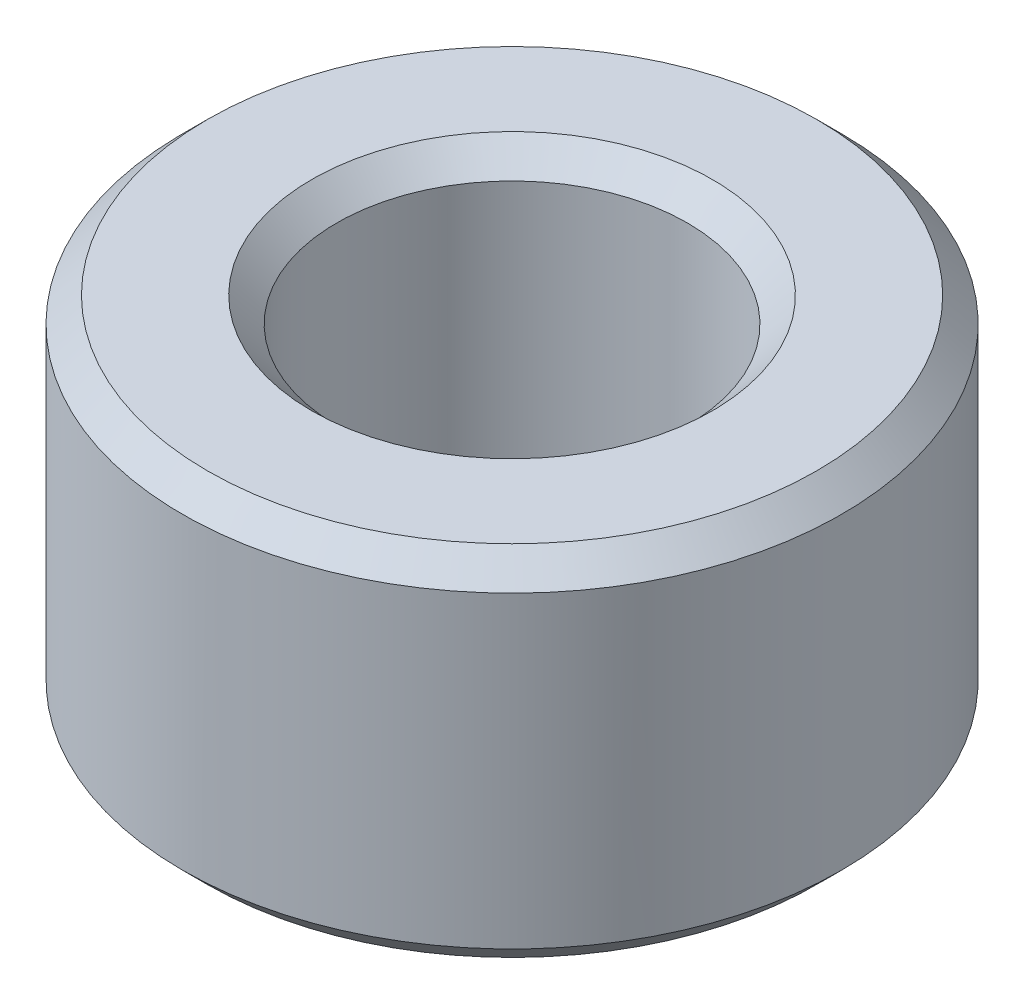
ISO-10303-21;
HEADER;
FILE_DESCRIPTION(('STEP AP214'),'2;1');
FILE_NAME('part.step','',(''),(''),'','','');
FILE_SCHEMA(('AUTOMOTIVE_DESIGN { 1 0 10303 214 1 1 1 1 }'));
ENDSEC;
DATA;
#1=APPLICATION_CONTEXT('core data for automotive mechanical design processes');
#2=APPLICATION_PROTOCOL_DEFINITION('international standard','automotive_design',2000,#1);
#3=PRODUCT_CONTEXT('',#1,'mechanical');
#4=PRODUCT('Part','Part','',(#3));
#5=PRODUCT_RELATED_PRODUCT_CATEGORY('part','',(#4));
#6=PRODUCT_DEFINITION_FORMATION('','',#4);
#7=PRODUCT_DEFINITION_CONTEXT('part definition',#1,'design');
#8=PRODUCT_DEFINITION('design','',#6,#7);
#9=PRODUCT_DEFINITION_SHAPE('','',#8);
#10=(LENGTH_UNIT() NAMED_UNIT(*) SI_UNIT(.MILLI.,.METRE.));
#11=(NAMED_UNIT(*) PLANE_ANGLE_UNIT() SI_UNIT($,.RADIAN.));
#12=(NAMED_UNIT(*) SI_UNIT($,.STERADIAN.) SOLID_ANGLE_UNIT());
#13=UNCERTAINTY_MEASURE_WITH_UNIT(LENGTH_MEASURE(1.E-05),#10,'distance_accuracy_value','');
#14=(GEOMETRIC_REPRESENTATION_CONTEXT(3) GLOBAL_UNCERTAINTY_ASSIGNED_CONTEXT((#13)) GLOBAL_UNIT_ASSIGNED_CONTEXT((#10,
#11,#12)) REPRESENTATION_CONTEXT('',''));
#15=CARTESIAN_POINT('',(0.,0.,0.));
#16=DIRECTION('',(0.,0.,1.));
#17=DIRECTION('',(1.,0.,0.));
#18=AXIS2_PLACEMENT_3D('',#15,#16,#17);
#19=CARTESIAN_POINT('',(0.,43.4858644077798,0.));
#20=DIRECTION('',(0.,-1.,0.));
#21=DIRECTION('',(0.,0.,-1.));
#22=AXIS2_PLACEMENT_3D('',#19,#20,#21);
#23=CYLINDRICAL_SURFACE('',#22,40.);
#24=CARTESIAN_POINT('',(0.,3.04222221616134,0.));
#25=DIRECTION('',(0.,1.,0.));
#26=DIRECTION('',(0.,0.,1.));
#27=AXIS2_PLACEMENT_3D('',#24,#25,#26);
#28=CIRCLE('',#27,40.);
#29=CARTESIAN_POINT('',(0.,3.04222221616134,-40.));
#30=VERTEX_POINT('',#29);
#31=EDGE_CURVE('E10',#30,#30,#28,.T.);
#32=CARTESIAN_POINT('',(0.,40.4436421916186,0.));
#33=DIRECTION('',(0.,1.,0.));
#34=DIRECTION('',(0.,0.,1.));
#35=AXIS2_PLACEMENT_3D('',#32,#33,#34);
#36=CIRCLE('',#35,40.);
#37=CARTESIAN_POINT('',(0.,40.4436421916186,-40.));
#38=VERTEX_POINT('',#37);
#39=EDGE_CURVE('E50',#38,#38,#36,.F.);
#40=CARTESIAN_POINT('',(0.,3.04222221616134,-40.));
#41=CARTESIAN_POINT('',(0.,3.43182034090568,-40.));
#42=CARTESIAN_POINT('',(0.,3.82141846565003,-40.));
#43=CARTESIAN_POINT('',(0.,4.60061471513872,-40.));
#44=CARTESIAN_POINT('',(0.,4.99021283988307,-40.));
#45=CARTESIAN_POINT('',(0.,5.76940908937176,-40.));
#46=CARTESIAN_POINT('',(0.,6.15900721411611,-40.));
#47=CARTESIAN_POINT('',(0.,6.9382034636048,-40.));
#48=CARTESIAN_POINT('',(0.,7.32780158834914,-40.));
#49=CARTESIAN_POINT('',(0.,8.10699783783783,-40.));
#50=CARTESIAN_POINT('',(0.,8.49659596258218,-40.));
#51=CARTESIAN_POINT('',(0.,9.27579221207087,-40.));
#52=CARTESIAN_POINT('',(0.,9.66539033681522,-40.));
#53=CARTESIAN_POINT('',(0.,10.4445865863039,-40.));
#54=CARTESIAN_POINT('',(0.,10.8341847110483,-40.));
#55=CARTESIAN_POINT('',(0.,11.613380960537,-40.));
#56=CARTESIAN_POINT('',(0.,12.0029790852813,-40.));
#57=CARTESIAN_POINT('',(0.,12.78217533477,-40.));
#58=CARTESIAN_POINT('',(0.,13.1717734595143,-40.));
#59=CARTESIAN_POINT('',(0.,13.950969709003,-40.));
#60=CARTESIAN_POINT('',(0.,14.3405678337474,-40.));
#61=CARTESIAN_POINT('',(0.,15.1197640832361,-40.));
#62=CARTESIAN_POINT('',(0.,15.5093622079804,-40.));
#63=CARTESIAN_POINT('',(0.,16.2885584574691,-40.));
#64=CARTESIAN_POINT('',(0.,16.6781565822135,-40.));
#65=CARTESIAN_POINT('',(0.,17.4573528317021,-40.));
#66=CARTESIAN_POINT('',(0.,17.8469509564465,-40.));
#67=CARTESIAN_POINT('',(0.,18.6261472059352,-40.));
#68=CARTESIAN_POINT('',(0.,19.0157453306795,-40.));
#69=CARTESIAN_POINT('',(0.,19.7949415801682,-40.));
#70=CARTESIAN_POINT('',(0.,20.1845397049126,-40.));
#71=CARTESIAN_POINT('',(0.,20.9637359544013,-40.));
#72=CARTESIAN_POINT('',(0.,21.3533340791456,-40.));
#73=CARTESIAN_POINT('',(0.,22.1325303286343,-40.));
#74=CARTESIAN_POINT('',(0.,22.5221284533786,-40.));
#75=CARTESIAN_POINT('',(0.,23.3013247028673,-40.));
#76=CARTESIAN_POINT('',(0.,23.6909228276117,-40.));
#77=CARTESIAN_POINT('',(0.,24.4701190771004,-40.));
#78=CARTESIAN_POINT('',(0.,24.8597172018447,-40.));
#79=CARTESIAN_POINT('',(0.,25.6389134513334,-40.));
#80=CARTESIAN_POINT('',(0.,26.0285115760778,-40.));
#81=CARTESIAN_POINT('',(0.,26.8077078255664,-40.));
#82=CARTESIAN_POINT('',(0.,27.1973059503108,-40.));
#83=CARTESIAN_POINT('',(0.,27.9765021997995,-40.));
#84=CARTESIAN_POINT('',(0.,28.3661003245438,-40.));
#85=CARTESIAN_POINT('',(0.,29.1452965740325,-40.));
#86=CARTESIAN_POINT('',(0.,29.5348946987769,-40.));
#87=CARTESIAN_POINT('',(0.,30.3140909482656,-40.));
#88=CARTESIAN_POINT('',(0.,30.7036890730099,-40.));
#89=CARTESIAN_POINT('',(0.,31.4828853224986,-40.));
#90=CARTESIAN_POINT('',(0.,31.872483447243,-40.));
#91=CARTESIAN_POINT('',(0.,32.6516796967316,-40.));
#92=CARTESIAN_POINT('',(0.,33.041277821476,-40.));
#93=CARTESIAN_POINT('',(0.,33.8204740709647,-40.));
#94=CARTESIAN_POINT('',(0.,34.210072195709,-40.));
#95=CARTESIAN_POINT('',(0.,34.9892684451977,-40.));
#96=CARTESIAN_POINT('',(0.,35.3788665699421,-40.));
#97=CARTESIAN_POINT('',(0.,36.1580628194308,-40.));
#98=CARTESIAN_POINT('',(0.,36.5476609441751,-40.));
#99=CARTESIAN_POINT('',(0.,37.3268571936638,-40.));
#100=CARTESIAN_POINT('',(0.,37.7164553184081,-40.));
#101=CARTESIAN_POINT('',(0.,38.4956515678968,-40.));
#102=CARTESIAN_POINT('',(0.,38.8852496926412,-40.));
#103=CARTESIAN_POINT('',(0.,39.6644459421299,-40.));
#104=CARTESIAN_POINT('',(0.,40.0540440668742,-40.));
#105=CARTESIAN_POINT('',(0.,40.4436421916186,-40.));
#106=B_SPLINE_CURVE_WITH_KNOTS('',3,(#40,#41,#42,#43,#44,#45,#46,#47,#48,#49,#50,#51,#52,#53,
#54,#55,#56,#57,#58,#59,#60,#61,#62,#63,#64,#65,#66,#67,#68,#69,#70,#71,#72,#73,#74,#75,#76,#77,
#78,#79,#80,#81,#82,#83,#84,#85,#86,#87,#88,#89,#90,#91,#92,#93,#94,#95,#96,#97,#98,#99,#100,
#101,#102,#103,#104,#105),.UNSPECIFIED.,.F.,.F.,(4,2,2,2,2,2,2,2,2,2,2,2,2,2,2,2,2,2,2,2,2,2,2,
2,2,2,2,2,2,2,2,2,4),(0.,1.16879437423304,2.33758874846608,3.50638312269912,4.67517749693215,
5.84397187116519,7.01276624539823,8.18156061963127,9.35035499386431,10.5191493680973,
11.6879437423304,12.8567381165634,14.0255324907965,15.1943268650295,16.3631212392625,
17.5319156134956,18.7007099877286,19.8695043619617,21.0382987361947,22.2070931104277,
23.3758874846608,24.5446818588938,25.7134762331268,26.8822706073599,28.0510649815929,
29.219859355826,30.388653730059,31.557448104292,32.7262424785251,33.8950368527581,
35.0638312269912,36.2326256012242,37.4014199754572),.UNSPECIFIED.);
#107=EDGE_CURVE('BSEAM39',#30,#38,#106,.T.);
#108=ORIENTED_EDGE('',*,*,#31,.T.);
#109=ORIENTED_EDGE('',*,*,#39,.T.);
#110=ORIENTED_EDGE('',*,*,#107,.T.);
#111=ORIENTED_EDGE('',*,*,#107,.F.);
#112=EDGE_LOOP('',(#108,#110,#109,#111));
#113=FACE_BOUND('',#112,.T.);
#114=ADVANCED_FACE('F39',(#113),#23,.T.);
#115=CARTESIAN_POINT('',(0.,43.4858644077798,0.));
#116=DIRECTION('',(0.,1.,0.));
#117=DIRECTION('',(0.,0.,1.));
#118=AXIS2_PLACEMENT_3D('',#115,#116,#117);
#119=PLANE('',#118);
#120=CARTESIAN_POINT('',(0.,43.4858644077798,0.));
#121=DIRECTION('',(0.,1.,0.));
#122=DIRECTION('',(0.,0.,1.));
#123=AXIS2_PLACEMENT_3D('',#120,#121,#122);
#124=CIRCLE('',#123,24.3196774041733);
#125=CARTESIAN_POINT('',(0.,43.4858644077798,24.3196774041733));
#126=VERTEX_POINT('',#125);
#127=EDGE_CURVE('E58',#126,#126,#124,.F.);
#128=ORIENTED_EDGE('',*,*,#127,.T.);
#129=EDGE_LOOP('',(#128));
#130=FACE_BOUND('',#129,.T.);
#131=CARTESIAN_POINT('',(0.,43.4858644077798,0.));
#132=DIRECTION('',(0.,1.,0.));
#133=DIRECTION('',(0.,0.,1.));
#134=AXIS2_PLACEMENT_3D('',#131,#132,#133);
#135=CIRCLE('',#134,36.9577777838388);
#136=CARTESIAN_POINT('',(0.,43.4858644077798,36.9577777838388));
#137=VERTEX_POINT('',#136);
#138=EDGE_CURVE('E61',#137,#137,#135,.T.);
#139=ORIENTED_EDGE('',*,*,#138,.T.);
#140=EDGE_LOOP('',(#139));
#141=FACE_BOUND('',#140,.T.);
#142=ADVANCED_FACE('F88',(#130,#141),#119,.T.);
#143=CARTESIAN_POINT('',(0.,0.,0.));
#144=DIRECTION('',(0.,1.,0.));
#145=DIRECTION('',(0.,0.,1.));
#146=AXIS2_PLACEMENT_3D('',#143,#144,#145);
#147=PLANE('',#146);
#148=CARTESIAN_POINT('',(0.,0.,0.));
#149=DIRECTION('',(0.,1.,0.));
#150=DIRECTION('',(0.,0.,1.));
#151=AXIS2_PLACEMENT_3D('',#148,#149,#150);
#152=CIRCLE('',#151,24.3196774041732);
#153=CARTESIAN_POINT('',(0.,0.,24.3196774041732));
#154=VERTEX_POINT('',#153);
#155=EDGE_CURVE('E51',#154,#154,#152,.T.);
#156=ORIENTED_EDGE('',*,*,#155,.T.);
#157=EDGE_LOOP('',(#156));
#158=FACE_BOUND('',#157,.T.);
#159=CARTESIAN_POINT('',(0.,0.,0.));
#160=DIRECTION('',(0.,1.,0.));
#161=DIRECTION('',(0.,0.,1.));
#162=AXIS2_PLACEMENT_3D('',#159,#160,#161);
#163=CIRCLE('',#162,36.9577777838387);
#164=CARTESIAN_POINT('',(0.,0.,36.9577777838387));
#165=VERTEX_POINT('',#164);
#166=EDGE_CURVE('E54',#165,#165,#163,.F.);
#167=ORIENTED_EDGE('',*,*,#166,.T.);
#168=EDGE_LOOP('',(#167));
#169=FACE_BOUND('',#168,.T.);
#170=ADVANCED_FACE('F83',(#158,#169),#147,.F.);
#171=CARTESIAN_POINT('',(0.,43.4858644077798,0.));
#172=DIRECTION('',(0.,-1.,0.));
#173=DIRECTION('',(0.,0.,-1.));
#174=AXIS2_PLACEMENT_3D('',#171,#172,#173);
#175=CYLINDRICAL_SURFACE('',#174,21.277455188012);
#176=CARTESIAN_POINT('',(0.,40.4436421916185,0.));
#177=DIRECTION('',(0.,1.,0.));
#178=DIRECTION('',(0.,0.,1.));
#179=AXIS2_PLACEMENT_3D('',#176,#177,#178);
#180=CIRCLE('',#179,21.277455188012);
#181=CARTESIAN_POINT('',(0.,40.4436421916185,-21.277455188012));
#182=VERTEX_POINT('',#181);
#183=EDGE_CURVE('E67',#182,#182,#180,.T.);
#184=CARTESIAN_POINT('',(0.,3.0422222161612,0.));
#185=DIRECTION('',(0.,1.,0.));
#186=DIRECTION('',(0.,0.,1.));
#187=AXIS2_PLACEMENT_3D('',#184,#185,#186);
#188=CIRCLE('',#187,21.277455188012);
#189=CARTESIAN_POINT('',(0.,3.0422222161612,-21.277455188012));
#190=VERTEX_POINT('',#189);
#191=EDGE_CURVE('E69',#190,#190,#188,.F.);
#192=CARTESIAN_POINT('',(0.,40.4436421916185,-21.277455188012));
#193=CARTESIAN_POINT('',(0.,40.0540440668742,-21.277455188012));
#194=CARTESIAN_POINT('',(0.,39.6644459421298,-21.277455188012));
#195=CARTESIAN_POINT('',(0.,38.8852496926411,-21.277455188012));
#196=CARTESIAN_POINT('',(0.,38.4956515678968,-21.277455188012));
#197=CARTESIAN_POINT('',(0.,37.7164553184081,-21.277455188012));
#198=CARTESIAN_POINT('',(0.,37.3268571936637,-21.277455188012));
#199=CARTESIAN_POINT('',(0.,36.547660944175,-21.277455188012));
#200=CARTESIAN_POINT('',(0.,36.1580628194307,-21.277455188012));
#201=CARTESIAN_POINT('',(0.,35.378866569942,-21.277455188012));
#202=CARTESIAN_POINT('',(0.,34.9892684451977,-21.277455188012));
#203=CARTESIAN_POINT('',(0.,34.210072195709,-21.277455188012));
#204=CARTESIAN_POINT('',(0.,33.8204740709646,-21.277455188012));
#205=CARTESIAN_POINT('',(0.,33.0412778214759,-21.277455188012));
#206=CARTESIAN_POINT('',(0.,32.6516796967316,-21.277455188012));
#207=CARTESIAN_POINT('',(0.,31.8724834472429,-21.277455188012));
#208=CARTESIAN_POINT('',(0.,31.4828853224985,-21.277455188012));
#209=CARTESIAN_POINT('',(0.,30.7036890730098,-21.277455188012));
#210=CARTESIAN_POINT('',(0.,30.3140909482655,-21.277455188012));
#211=CARTESIAN_POINT('',(0.,29.5348946987768,-21.277455188012));
#212=CARTESIAN_POINT('',(0.,29.1452965740325,-21.277455188012));
#213=CARTESIAN_POINT('',(0.,28.3661003245438,-21.277455188012));
#214=CARTESIAN_POINT('',(0.,27.9765021997994,-21.277455188012));
#215=CARTESIAN_POINT('',(0.,27.1973059503107,-21.277455188012));
#216=CARTESIAN_POINT('',(0.,26.8077078255664,-21.277455188012));
#217=CARTESIAN_POINT('',(0.,26.0285115760777,-21.277455188012));
#218=CARTESIAN_POINT('',(0.,25.6389134513333,-21.277455188012));
#219=CARTESIAN_POINT('',(0.,24.8597172018446,-21.277455188012));
#220=CARTESIAN_POINT('',(0.,24.4701190771003,-21.277455188012));
#221=CARTESIAN_POINT('',(0.,23.6909228276116,-21.277455188012));
#222=CARTESIAN_POINT('',(0.,23.3013247028672,-21.277455188012));
#223=CARTESIAN_POINT('',(0.,22.5221284533785,-21.277455188012));
#224=CARTESIAN_POINT('',(0.,22.1325303286342,-21.277455188012));
#225=CARTESIAN_POINT('',(0.,21.3533340791455,-21.277455188012));
#226=CARTESIAN_POINT('',(0.,20.9637359544012,-21.277455188012));
#227=CARTESIAN_POINT('',(0.,20.1845397049125,-21.277455188012));
#228=CARTESIAN_POINT('',(0.,19.7949415801681,-21.277455188012));
#229=CARTESIAN_POINT('',(0.,19.0157453306794,-21.277455188012));
#230=CARTESIAN_POINT('',(0.,18.6261472059351,-21.277455188012));
#231=CARTESIAN_POINT('',(0.,17.8469509564464,-21.277455188012));
#232=CARTESIAN_POINT('',(0.,17.457352831702,-21.277455188012));
#233=CARTESIAN_POINT('',(0.,16.6781565822133,-21.277455188012));
#234=CARTESIAN_POINT('',(0.,16.288558457469,-21.277455188012));
#235=CARTESIAN_POINT('',(0.,15.5093622079803,-21.277455188012));
#236=CARTESIAN_POINT('',(0.,15.119764083236,-21.277455188012));
#237=CARTESIAN_POINT('',(0.,14.3405678337473,-21.277455188012));
#238=CARTESIAN_POINT('',(0.,13.9509697090029,-21.277455188012));
#239=CARTESIAN_POINT('',(0.,13.1717734595142,-21.277455188012));
#240=CARTESIAN_POINT('',(0.,12.7821753347699,-21.277455188012));
#241=CARTESIAN_POINT('',(0.,12.0029790852812,-21.277455188012));
#242=CARTESIAN_POINT('',(0.,11.6133809605368,-21.277455188012));
#243=CARTESIAN_POINT('',(0.,10.8341847110481,-21.277455188012));
#244=CARTESIAN_POINT('',(0.,10.4445865863038,-21.277455188012));
#245=CARTESIAN_POINT('',(0.,9.66539033681509,-21.277455188012));
#246=CARTESIAN_POINT('',(0.,9.27579221207075,-21.277455188012));
#247=CARTESIAN_POINT('',(0.,8.49659596258205,-21.277455188012));
#248=CARTESIAN_POINT('',(0.,8.10699783783771,-21.277455188012));
#249=CARTESIAN_POINT('',(0.,7.32780158834901,-21.277455188012));
#250=CARTESIAN_POINT('',(0.,6.93820346360466,-21.277455188012));
#251=CARTESIAN_POINT('',(0.,6.15900721411597,-21.277455188012));
#252=CARTESIAN_POINT('',(0.,5.76940908937162,-21.277455188012));
#253=CARTESIAN_POINT('',(0.,4.99021283988293,-21.277455188012));
#254=CARTESIAN_POINT('',(0.,4.60061471513858,-21.277455188012));
#255=CARTESIAN_POINT('',(0.,3.82141846564989,-21.277455188012));
#256=CARTESIAN_POINT('',(0.,3.43182034090554,-21.277455188012));
#257=CARTESIAN_POINT('',(0.,3.0422222161612,-21.277455188012));
#258=B_SPLINE_CURVE_WITH_KNOTS('',3,(#192,#193,#194,#195,#196,#197,#198,#199,#200,#201,#202,
#203,#204,#205,#206,#207,#208,#209,#210,#211,#212,#213,#214,#215,#216,#217,#218,#219,#220,#221,
#222,#223,#224,#225,#226,#227,#228,#229,#230,#231,#232,#233,#234,#235,#236,#237,#238,#239,#240,
#241,#242,#243,#244,#245,#246,#247,#248,#249,#250,#251,#252,#253,#254,#255,#256,#257),
.UNSPECIFIED.,.F.,.F.,(4,2,2,2,2,2,2,2,2,2,2,2,2,2,2,2,2,2,2,2,2,2,2,2,2,2,2,2,2,2,2,2,4),(0.,
1.16879437423304,2.33758874846609,3.50638312269913,4.67517749693217,5.84397187116521,
7.01276624539825,8.18156061963129,9.35035499386434,10.5191493680974,11.6879437423304,
12.8567381165635,14.0255324907965,15.1943268650295,16.3631212392626,17.5319156134956,
18.7007099877287,19.8695043619617,21.0382987361947,22.2070931104278,23.3758874846608,
24.5446818588939,25.7134762331269,26.88227060736,28.051064981593,29.219859355826,
30.3886537300591,31.5574481042921,32.7262424785252,33.8950368527582,35.0638312269912,
36.2326256012243,37.4014199754573),.UNSPECIFIED.);
#259=EDGE_CURVE('BSEAM71',#182,#190,#258,.T.);
#260=ORIENTED_EDGE('',*,*,#183,.T.);
#261=ORIENTED_EDGE('',*,*,#191,.T.);
#262=ORIENTED_EDGE('',*,*,#259,.T.);
#263=ORIENTED_EDGE('',*,*,#259,.F.);
#264=EDGE_LOOP('',(#260,#262,#261,#263));
#265=FACE_BOUND('',#264,.T.);
#266=ADVANCED_FACE('F71',(#265),#175,.F.);
#267=CARTESIAN_POINT('',(0.,40.4436421916185,0.));
#268=DIRECTION('',(0.,1.,0.));
#269=DIRECTION('',(0.,0.,1.));
#270=AXIS2_PLACEMENT_3D('',#267,#268,#269);
#271=CONICAL_SURFACE('',#270,21.277455188012,0.785398163397452);
#272=ORIENTED_EDGE('',*,*,#127,.F.);
#273=EDGE_LOOP('',(#272));
#274=FACE_BOUND('',#273,.T.);
#275=ORIENTED_EDGE('',*,*,#183,.F.);
#276=EDGE_LOOP('',(#275));
#277=FACE_BOUND('',#276,.T.);
#278=ADVANCED_FACE('F77',(#274,#277),#271,.F.);
#279=CARTESIAN_POINT('',(0.,0.,0.));
#280=DIRECTION('',(0.,-1.,0.));
#281=DIRECTION('',(0.,0.,-1.));
#282=AXIS2_PLACEMENT_3D('',#279,#280,#281);
#283=CONICAL_SURFACE('',#282,24.3196774041732,0.785398163397442);
#284=ORIENTED_EDGE('',*,*,#191,.F.);
#285=EDGE_LOOP('',(#284));
#286=FACE_BOUND('',#285,.T.);
#287=ORIENTED_EDGE('',*,*,#155,.F.);
#288=EDGE_LOOP('',(#287));
#289=FACE_BOUND('',#288,.T.);
#290=ADVANCED_FACE('F73',(#286,#289),#283,.F.);
#291=CARTESIAN_POINT('',(0.,3.04222221616133,0.));
#292=DIRECTION('',(0.,1.,0.));
#293=DIRECTION('',(0.,0.,1.));
#294=AXIS2_PLACEMENT_3D('',#291,#292,#293);
#295=CONICAL_SURFACE('',#294,40.,0.785398163397452);
#296=ORIENTED_EDGE('',*,*,#166,.F.);
#297=EDGE_LOOP('',(#296));
#298=FACE_BOUND('',#297,.T.);
#299=ORIENTED_EDGE('',*,*,#31,.F.);
#300=EDGE_LOOP('',(#299));
#301=FACE_BOUND('',#300,.T.);
#302=ADVANCED_FACE('F76',(#298,#301),#295,.T.);
#303=CARTESIAN_POINT('',(0.,43.4858644077798,0.));
#304=DIRECTION('',(0.,-1.,0.));
#305=DIRECTION('',(0.,0.,-1.));
#306=AXIS2_PLACEMENT_3D('',#303,#304,#305);
#307=CONICAL_SURFACE('',#306,36.9577777838388,0.785398163397442);
#308=ORIENTED_EDGE('',*,*,#39,.F.);
#309=EDGE_LOOP('',(#308));
#310=FACE_BOUND('',#309,.T.);
#311=ORIENTED_EDGE('',*,*,#138,.F.);
#312=EDGE_LOOP('',(#311));
#313=FACE_BOUND('',#312,.T.);
#314=ADVANCED_FACE('F45',(#310,#313),#307,.T.);
#315=CLOSED_SHELL('',(#114,#142,#170,#266,#278,#290,#302,#314));
#316=MANIFOLD_SOLID_BREP('B2',#315);
#317=ADVANCED_BREP_SHAPE_REPRESENTATION('',(#18,#316),#14);
#318=SHAPE_DEFINITION_REPRESENTATION(#9,#317);
ENDSEC;
END-ISO-10303-21;
